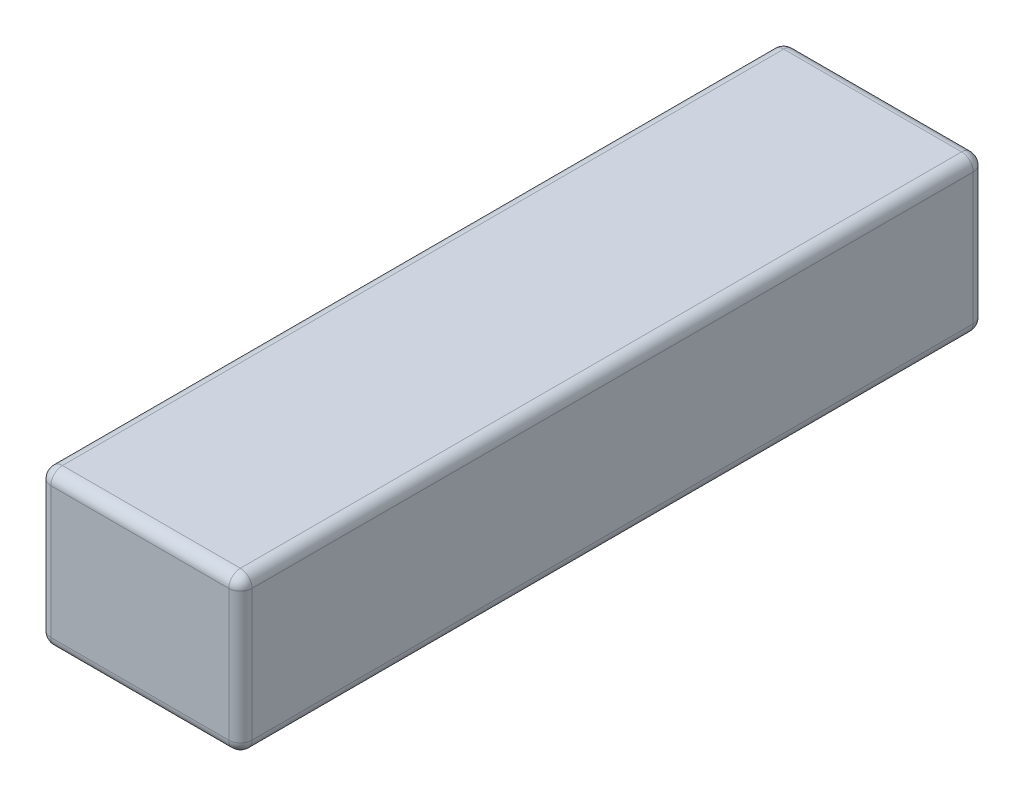
ISO-10303-21;
HEADER;
FILE_DESCRIPTION(('STEP AP214'),'2;1');
FILE_NAME('part.step','',(''),(''),'','','');
FILE_SCHEMA(('AUTOMOTIVE_DESIGN { 1 0 10303 214 1 1 1 1 }'));
ENDSEC;
DATA;
#1=APPLICATION_CONTEXT('core data for automotive mechanical design processes');
#2=APPLICATION_PROTOCOL_DEFINITION('international standard','automotive_design',2000,#1);
#3=PRODUCT_CONTEXT('',#1,'mechanical');
#4=PRODUCT('Part','Part','',(#3));
#5=PRODUCT_RELATED_PRODUCT_CATEGORY('part','',(#4));
#6=PRODUCT_DEFINITION_FORMATION('','',#4);
#7=PRODUCT_DEFINITION_CONTEXT('part definition',#1,'design');
#8=PRODUCT_DEFINITION('design','',#6,#7);
#9=PRODUCT_DEFINITION_SHAPE('','',#8);
#10=(LENGTH_UNIT() NAMED_UNIT(*) SI_UNIT(.MILLI.,.METRE.));
#11=(NAMED_UNIT(*) PLANE_ANGLE_UNIT() SI_UNIT($,.RADIAN.));
#12=(NAMED_UNIT(*) SI_UNIT($,.STERADIAN.) SOLID_ANGLE_UNIT());
#13=UNCERTAINTY_MEASURE_WITH_UNIT(LENGTH_MEASURE(1.E-05),#10,'distance_accuracy_value','');
#14=(GEOMETRIC_REPRESENTATION_CONTEXT(3) GLOBAL_UNCERTAINTY_ASSIGNED_CONTEXT((#13)) GLOBAL_UNIT_ASSIGNED_CONTEXT((#10,
#11,#12)) REPRESENTATION_CONTEXT('',''));
#15=CARTESIAN_POINT('',(0.,0.,0.));
#16=DIRECTION('',(0.,0.,1.));
#17=DIRECTION('',(1.,0.,0.));
#18=AXIS2_PLACEMENT_3D('',#15,#16,#17);
#19=CARTESIAN_POINT('',(-8.65,6.65,64.));
#20=DIRECTION('',(1.,0.,0.));
#21=DIRECTION('',(0.,1.,0.));
#22=AXIS2_PLACEMENT_3D('',#19,#20,#21);
#23=PLANE('',#22);
#24=DIRECTION('',(0.,0.,-1.));
#25=VECTOR('',#24,1.);
#26=CARTESIAN_POINT('',(-8.65,-5.65,64.));
#27=LINE('',#26,#25);
#28=CARTESIAN_POINT('',(-8.65,-5.65,1.));
#29=VERTEX_POINT('',#28);
#30=CARTESIAN_POINT('',(-8.65,-5.65,63.));
#31=VERTEX_POINT('',#30);
#32=EDGE_CURVE('E135',#29,#31,#27,.F.);
#33=ORIENTED_EDGE('',*,*,#32,.T.);
#34=DIRECTION('',(0.,-1.,0.));
#35=VECTOR('',#34,1.);
#36=CARTESIAN_POINT('',(-8.65,6.65,63.));
#37=LINE('',#36,#35);
#38=CARTESIAN_POINT('',(-8.65,5.65,63.));
#39=VERTEX_POINT('',#38);
#40=EDGE_CURVE('E181',#31,#39,#37,.F.);
#41=ORIENTED_EDGE('',*,*,#40,.T.);
#42=DIRECTION('',(0.,0.,-1.));
#43=VECTOR('',#42,1.);
#44=CARTESIAN_POINT('',(-8.65,5.65,64.));
#45=LINE('',#44,#43);
#46=CARTESIAN_POINT('',(-8.65,5.65,1.));
#47=VERTEX_POINT('',#46);
#48=EDGE_CURVE('E176',#39,#47,#45,.T.);
#49=ORIENTED_EDGE('',*,*,#48,.T.);
#50=DIRECTION('',(0.,-1.,0.));
#51=VECTOR('',#50,1.);
#52=CARTESIAN_POINT('',(-8.65,6.65,1.));
#53=LINE('',#52,#51);
#54=EDGE_CURVE('E170',#47,#29,#53,.T.);
#55=ORIENTED_EDGE('',*,*,#54,.T.);
#56=EDGE_LOOP('',(#33,#41,#49,#55));
#57=FACE_BOUND('',#56,.T.);
#58=ADVANCED_FACE('F39',(#57),#23,.F.);
#59=CARTESIAN_POINT('',(-8.65,-6.65,64.));
#60=DIRECTION('',(0.,1.,0.));
#61=DIRECTION('',(0.,0.,1.));
#62=AXIS2_PLACEMENT_3D('',#59,#60,#61);
#63=PLANE('',#62);
#64=DIRECTION('',(0.,0.,-1.));
#65=VECTOR('',#64,1.);
#66=CARTESIAN_POINT('',(7.65,-6.65,64.));
#67=LINE('',#66,#65);
#68=CARTESIAN_POINT('',(7.65,-6.65,1.));
#69=VERTEX_POINT('',#68);
#70=CARTESIAN_POINT('',(7.65,-6.65,63.));
#71=VERTEX_POINT('',#70);
#72=EDGE_CURVE('E160',#69,#71,#67,.F.);
#73=ORIENTED_EDGE('',*,*,#72,.T.);
#74=DIRECTION('',(1.,0.,0.));
#75=VECTOR('',#74,1.);
#76=CARTESIAN_POINT('',(-8.65,-6.65,63.));
#77=LINE('',#76,#75);
#78=CARTESIAN_POINT('',(-7.65,-6.65,63.));
#79=VERTEX_POINT('',#78);
#80=EDGE_CURVE('E164',#71,#79,#77,.F.);
#81=ORIENTED_EDGE('',*,*,#80,.T.);
#82=DIRECTION('',(0.,0.,-1.));
#83=VECTOR('',#82,1.);
#84=CARTESIAN_POINT('',(-7.65,-6.65,64.));
#85=LINE('',#84,#83);
#86=CARTESIAN_POINT('',(-7.65,-6.65,1.));
#87=VERTEX_POINT('',#86);
#88=EDGE_CURVE('E133',#79,#87,#85,.T.);
#89=ORIENTED_EDGE('',*,*,#88,.T.);
#90=DIRECTION('',(1.,0.,0.));
#91=VECTOR('',#90,1.);
#92=CARTESIAN_POINT('',(-8.65,-6.65,1.));
#93=LINE('',#92,#91);
#94=EDGE_CURVE('E153',#87,#69,#93,.T.);
#95=ORIENTED_EDGE('',*,*,#94,.T.);
#96=EDGE_LOOP('',(#73,#81,#89,#95));
#97=FACE_BOUND('',#96,.T.);
#98=ADVANCED_FACE('F162',(#97),#63,.F.);
#99=CARTESIAN_POINT('',(8.65,6.65,64.));
#100=DIRECTION('',(-1.,0.,0.));
#101=DIRECTION('',(0.,-1.,0.));
#102=AXIS2_PLACEMENT_3D('',#99,#100,#101);
#103=PLANE('',#102);
#104=DIRECTION('',(0.,0.,-1.));
#105=VECTOR('',#104,1.);
#106=CARTESIAN_POINT('',(8.65,5.65,64.));
#107=LINE('',#106,#105);
#108=CARTESIAN_POINT('',(8.65,5.65,1.));
#109=VERTEX_POINT('',#108);
#110=CARTESIAN_POINT('',(8.65,5.65,63.));
#111=VERTEX_POINT('',#110);
#112=EDGE_CURVE('E187',#109,#111,#107,.F.);
#113=ORIENTED_EDGE('',*,*,#112,.T.);
#114=DIRECTION('',(0.,1.,0.));
#115=VECTOR('',#114,1.);
#116=CARTESIAN_POINT('',(8.65,-6.65,63.));
#117=LINE('',#116,#115);
#118=CARTESIAN_POINT('',(8.65,-5.65,63.));
#119=VERTEX_POINT('',#118);
#120=EDGE_CURVE('E194',#111,#119,#117,.F.);
#121=ORIENTED_EDGE('',*,*,#120,.T.);
#122=DIRECTION('',(0.,0.,-1.));
#123=VECTOR('',#122,1.);
#124=CARTESIAN_POINT('',(8.65,-5.65,64.));
#125=LINE('',#124,#123);
#126=CARTESIAN_POINT('',(8.65,-5.65,1.));
#127=VERTEX_POINT('',#126);
#128=EDGE_CURVE('E190',#119,#127,#125,.T.);
#129=ORIENTED_EDGE('',*,*,#128,.T.);
#130=DIRECTION('',(0.,1.,0.));
#131=VECTOR('',#130,1.);
#132=CARTESIAN_POINT('',(8.65,6.65,1.));
#133=LINE('',#132,#131);
#134=EDGE_CURVE('E184',#127,#109,#133,.T.);
#135=ORIENTED_EDGE('',*,*,#134,.T.);
#136=EDGE_LOOP('',(#113,#121,#129,#135));
#137=FACE_BOUND('',#136,.T.);
#138=ADVANCED_FACE('F333',(#137),#103,.F.);
#139=CARTESIAN_POINT('',(-8.65,6.65,64.));
#140=DIRECTION('',(0.,-1.,0.));
#141=DIRECTION('',(0.,0.,-1.));
#142=AXIS2_PLACEMENT_3D('',#139,#140,#141);
#143=PLANE('',#142);
#144=DIRECTION('',(0.,0.,-1.));
#145=VECTOR('',#144,1.);
#146=CARTESIAN_POINT('',(-7.65,6.65,64.));
#147=LINE('',#146,#145);
#148=CARTESIAN_POINT('',(-7.65,6.65,1.));
#149=VERTEX_POINT('',#148);
#150=CARTESIAN_POINT('',(-7.65,6.65,63.));
#151=VERTEX_POINT('',#150);
#152=EDGE_CURVE('E200',#149,#151,#147,.F.);
#153=ORIENTED_EDGE('',*,*,#152,.T.);
#154=DIRECTION('',(-1.,0.,0.));
#155=VECTOR('',#154,1.);
#156=CARTESIAN_POINT('',(8.65,6.65,63.));
#157=LINE('',#156,#155);
#158=CARTESIAN_POINT('',(7.65,6.65,63.));
#159=VERTEX_POINT('',#158);
#160=EDGE_CURVE('E207',#151,#159,#157,.F.);
#161=ORIENTED_EDGE('',*,*,#160,.T.);
#162=DIRECTION('',(0.,0.,-1.));
#163=VECTOR('',#162,1.);
#164=CARTESIAN_POINT('',(7.65,6.65,64.));
#165=LINE('',#164,#163);
#166=CARTESIAN_POINT('',(7.65,6.65,1.));
#167=VERTEX_POINT('',#166);
#168=EDGE_CURVE('E203',#159,#167,#165,.T.);
#169=ORIENTED_EDGE('',*,*,#168,.T.);
#170=DIRECTION('',(-1.,0.,0.));
#171=VECTOR('',#170,1.);
#172=CARTESIAN_POINT('',(-8.65,6.65,1.));
#173=LINE('',#172,#171);
#174=EDGE_CURVE('E197',#167,#149,#173,.T.);
#175=ORIENTED_EDGE('',*,*,#174,.T.);
#176=EDGE_LOOP('',(#153,#161,#169,#175));
#177=FACE_BOUND('',#176,.T.);
#178=ADVANCED_FACE('F343',(#177),#143,.F.);
#179=CARTESIAN_POINT('',(0.,0.,64.));
#180=DIRECTION('',(0.,0.,1.));
#181=DIRECTION('',(1.,0.,0.));
#182=AXIS2_PLACEMENT_3D('',#179,#180,#181);
#183=PLANE('',#182);
#184=DIRECTION('',(0.,1.,0.));
#185=VECTOR('',#184,1.);
#186=CARTESIAN_POINT('',(7.65,6.65,64.));
#187=LINE('',#186,#185);
#188=CARTESIAN_POINT('',(7.65,-5.65,64.));
#189=VERTEX_POINT('',#188);
#190=CARTESIAN_POINT('',(7.65,5.65,64.));
#191=VERTEX_POINT('',#190);
#192=EDGE_CURVE('E216',#189,#191,#187,.T.);
#193=ORIENTED_EDGE('',*,*,#192,.T.);
#194=DIRECTION('',(-1.,0.,0.));
#195=VECTOR('',#194,1.);
#196=CARTESIAN_POINT('',(-8.65,5.65,64.));
#197=LINE('',#196,#195);
#198=CARTESIAN_POINT('',(-7.65,5.65,64.));
#199=VERTEX_POINT('',#198);
#200=EDGE_CURVE('E219',#191,#199,#197,.T.);
#201=ORIENTED_EDGE('',*,*,#200,.T.);
#202=DIRECTION('',(0.,-1.,0.));
#203=VECTOR('',#202,1.);
#204=CARTESIAN_POINT('',(-7.65,-6.65,64.));
#205=LINE('',#204,#203);
#206=CARTESIAN_POINT('',(-7.65,-5.65,64.));
#207=VERTEX_POINT('',#206);
#208=EDGE_CURVE('E210',#199,#207,#205,.T.);
#209=ORIENTED_EDGE('',*,*,#208,.T.);
#210=DIRECTION('',(1.,0.,0.));
#211=VECTOR('',#210,1.);
#212=CARTESIAN_POINT('',(8.65,-5.65,64.));
#213=LINE('',#212,#211);
#214=EDGE_CURVE('E213',#207,#189,#213,.T.);
#215=ORIENTED_EDGE('',*,*,#214,.T.);
#216=EDGE_LOOP('',(#193,#201,#209,#215));
#217=FACE_BOUND('',#216,.T.);
#218=ADVANCED_FACE('F325',(#217),#183,.T.);
#219=CARTESIAN_POINT('',(0.,0.,0.));
#220=DIRECTION('',(0.,0.,1.));
#221=DIRECTION('',(1.,0.,0.));
#222=AXIS2_PLACEMENT_3D('',#219,#220,#221);
#223=PLANE('',#222);
#224=DIRECTION('',(0.,-1.,0.));
#225=VECTOR('',#224,1.);
#226=CARTESIAN_POINT('',(-7.65,0.,0.));
#227=LINE('',#226,#225);
#228=CARTESIAN_POINT('',(-7.65,-5.65,0.));
#229=VERTEX_POINT('',#228);
#230=CARTESIAN_POINT('',(-7.65,5.65,0.));
#231=VERTEX_POINT('',#230);
#232=EDGE_CURVE('E223',#229,#231,#227,.F.);
#233=ORIENTED_EDGE('',*,*,#232,.T.);
#234=DIRECTION('',(-1.,0.,0.));
#235=VECTOR('',#234,1.);
#236=CARTESIAN_POINT('',(0.,5.65,0.));
#237=LINE('',#236,#235);
#238=CARTESIAN_POINT('',(7.65,5.65,0.));
#239=VERTEX_POINT('',#238);
#240=EDGE_CURVE('E11',#231,#239,#237,.F.);
#241=ORIENTED_EDGE('',*,*,#240,.T.);
#242=DIRECTION('',(0.,1.,0.));
#243=VECTOR('',#242,1.);
#244=CARTESIAN_POINT('',(7.65,0.,0.));
#245=LINE('',#244,#243);
#246=CARTESIAN_POINT('',(7.65,-5.65,0.));
#247=VERTEX_POINT('',#246);
#248=EDGE_CURVE('E49',#239,#247,#245,.F.);
#249=ORIENTED_EDGE('',*,*,#248,.T.);
#250=DIRECTION('',(1.,0.,0.));
#251=VECTOR('',#250,1.);
#252=CARTESIAN_POINT('',(0.,-5.65,0.));
#253=LINE('',#252,#251);
#254=EDGE_CURVE('E226',#247,#229,#253,.F.);
#255=ORIENTED_EDGE('',*,*,#254,.T.);
#256=EDGE_LOOP('',(#233,#241,#249,#255));
#257=FACE_BOUND('',#256,.T.);
#258=ADVANCED_FACE('F532',(#257),#223,.F.);
#259=CARTESIAN_POINT('',(7.65,5.65,64.));
#260=DIRECTION('',(0.,0.,-1.));
#261=DIRECTION('',(-1.,0.,0.));
#262=AXIS2_PLACEMENT_3D('',#259,#260,#261);
#263=CYLINDRICAL_SURFACE('',#262,1.);
#264=CARTESIAN_POINT('',(7.65,5.65,63.));
#265=DIRECTION('',(0.,0.,1.));
#266=DIRECTION('',(1.,0.,0.));
#267=AXIS2_PLACEMENT_3D('',#264,#265,#266);
#268=CIRCLE('',#267,1.);
#269=EDGE_CURVE('E43',#111,#159,#268,.T.);
#270=ORIENTED_EDGE('',*,*,#269,.F.);
#271=ORIENTED_EDGE('',*,*,#112,.F.);
#272=CARTESIAN_POINT('',(7.65,5.65,1.));
#273=DIRECTION('',(0.,0.,-1.));
#274=DIRECTION('',(-1.,0.,0.));
#275=AXIS2_PLACEMENT_3D('',#272,#273,#274);
#276=CIRCLE('',#275,1.);
#277=EDGE_CURVE('E301',#167,#109,#276,.T.);
#278=ORIENTED_EDGE('',*,*,#277,.F.);
#279=ORIENTED_EDGE('',*,*,#168,.F.);
#280=EDGE_LOOP('',(#270,#271,#278,#279));
#281=FACE_BOUND('',#280,.T.);
#282=ADVANCED_FACE('F41',(#281),#263,.T.);
#283=CARTESIAN_POINT('',(7.65,5.65,63.));
#284=DIRECTION('',(0.,1.,0.));
#285=DIRECTION('',(-1.,0.,0.));
#286=AXIS2_PLACEMENT_3D('',#283,#284,#285);
#287=SPHERICAL_SURFACE('',#286,1.);
#288=CARTESIAN_POINT('',(7.65,5.65,63.));
#289=DIRECTION('',(0.,1.,0.));
#290=DIRECTION('',(0.,0.,1.));
#291=AXIS2_PLACEMENT_3D('',#288,#289,#290);
#292=CIRCLE('',#291,1.);
#293=EDGE_CURVE('E294',#111,#191,#292,.F.);
#294=ORIENTED_EDGE('',*,*,#293,.F.);
#295=ORIENTED_EDGE('',*,*,#269,.T.);
#296=CARTESIAN_POINT('',(7.65,5.65,63.));
#297=DIRECTION('',(1.,0.,0.));
#298=DIRECTION('',(0.,0.,-1.));
#299=AXIS2_PLACEMENT_3D('',#296,#297,#298);
#300=CIRCLE('',#299,1.);
#301=EDGE_CURVE('E298',#191,#159,#300,.F.);
#302=ORIENTED_EDGE('',*,*,#301,.F.);
#303=EDGE_LOOP('',(#294,#295,#302));
#304=FACE_BOUND('',#303,.T.);
#305=ADVANCED_FACE('F313',(#304),#287,.T.);
#306=CARTESIAN_POINT('',(7.65,5.65,1.));
#307=DIRECTION('',(1.,0.,0.));
#308=DIRECTION('',(0.,0.,-1.));
#309=AXIS2_PLACEMENT_3D('',#306,#307,#308);
#310=SPHERICAL_SURFACE('',#309,1.);
#311=CARTESIAN_POINT('',(7.65,5.65,1.));
#312=DIRECTION('',(1.,0.,0.));
#313=DIRECTION('',(0.,1.,0.));
#314=AXIS2_PLACEMENT_3D('',#311,#312,#313);
#315=CIRCLE('',#314,1.);
#316=EDGE_CURVE('E287',#167,#239,#315,.F.);
#317=ORIENTED_EDGE('',*,*,#316,.F.);
#318=ORIENTED_EDGE('',*,*,#277,.T.);
#319=CARTESIAN_POINT('',(7.65,5.65,1.));
#320=DIRECTION('',(0.,1.,0.));
#321=DIRECTION('',(0.,0.,1.));
#322=AXIS2_PLACEMENT_3D('',#319,#320,#321);
#323=CIRCLE('',#322,1.);
#324=EDGE_CURVE('E291',#239,#109,#323,.F.);
#325=ORIENTED_EDGE('',*,*,#324,.F.);
#326=EDGE_LOOP('',(#317,#318,#325));
#327=FACE_BOUND('',#326,.T.);
#328=ADVANCED_FACE('F511',(#327),#310,.T.);
#329=CARTESIAN_POINT('',(0.,5.65,63.));
#330=DIRECTION('',(1.,0.,0.));
#331=DIRECTION('',(0.,0.,-1.));
#332=AXIS2_PLACEMENT_3D('',#329,#330,#331);
#333=CYLINDRICAL_SURFACE('',#332,1.);
#334=ORIENTED_EDGE('',*,*,#301,.T.);
#335=ORIENTED_EDGE('',*,*,#160,.F.);
#336=CARTESIAN_POINT('',(-7.65,5.65,63.));
#337=DIRECTION('',(-1.,0.,0.));
#338=DIRECTION('',(0.,0.,1.));
#339=AXIS2_PLACEMENT_3D('',#336,#337,#338);
#340=CIRCLE('',#339,1.);
#341=EDGE_CURVE('E279',#199,#151,#340,.T.);
#342=ORIENTED_EDGE('',*,*,#341,.F.);
#343=ORIENTED_EDGE('',*,*,#200,.F.);
#344=EDGE_LOOP('',(#334,#335,#342,#343));
#345=FACE_BOUND('',#344,.T.);
#346=ADVANCED_FACE('F321',(#345),#333,.T.);
#347=CARTESIAN_POINT('',(7.65,0.,63.));
#348=DIRECTION('',(0.,-1.,0.));
#349=DIRECTION('',(1.,0.,0.));
#350=AXIS2_PLACEMENT_3D('',#347,#348,#349);
#351=CYLINDRICAL_SURFACE('',#350,1.);
#352=ORIENTED_EDGE('',*,*,#293,.T.);
#353=ORIENTED_EDGE('',*,*,#192,.F.);
#354=CARTESIAN_POINT('',(7.65,-5.65,63.));
#355=DIRECTION('',(0.,-1.,0.));
#356=DIRECTION('',(0.,0.,-1.));
#357=AXIS2_PLACEMENT_3D('',#354,#355,#356);
#358=CIRCLE('',#357,1.);
#359=EDGE_CURVE('E275',#119,#189,#358,.T.);
#360=ORIENTED_EDGE('',*,*,#359,.F.);
#361=ORIENTED_EDGE('',*,*,#120,.F.);
#362=EDGE_LOOP('',(#352,#353,#360,#361));
#363=FACE_BOUND('',#362,.T.);
#364=ADVANCED_FACE('F330',(#363),#351,.T.);
#365=CARTESIAN_POINT('',(7.65,-5.65,64.));
#366=DIRECTION('',(0.,0.,-1.));
#367=DIRECTION('',(-1.,0.,0.));
#368=AXIS2_PLACEMENT_3D('',#365,#366,#367);
#369=CYLINDRICAL_SURFACE('',#368,1.);
#370=CARTESIAN_POINT('',(7.65,-5.65,1.));
#371=DIRECTION('',(0.,0.,-1.));
#372=DIRECTION('',(-1.,0.,0.));
#373=AXIS2_PLACEMENT_3D('',#370,#371,#372);
#374=CIRCLE('',#373,1.);
#375=EDGE_CURVE('E267',#127,#69,#374,.T.);
#376=ORIENTED_EDGE('',*,*,#375,.F.);
#377=ORIENTED_EDGE('',*,*,#128,.F.);
#378=CARTESIAN_POINT('',(7.65,-5.65,63.));
#379=DIRECTION('',(0.,0.,1.));
#380=DIRECTION('',(1.,0.,0.));
#381=AXIS2_PLACEMENT_3D('',#378,#379,#380);
#382=CIRCLE('',#381,1.);
#383=EDGE_CURVE('E271',#71,#119,#382,.T.);
#384=ORIENTED_EDGE('',*,*,#383,.F.);
#385=ORIENTED_EDGE('',*,*,#72,.F.);
#386=EDGE_LOOP('',(#376,#377,#384,#385));
#387=FACE_BOUND('',#386,.T.);
#388=ADVANCED_FACE('F337',(#387),#369,.T.);
#389=CARTESIAN_POINT('',(7.65,6.65,1.));
#390=DIRECTION('',(0.,1.,0.));
#391=DIRECTION('',(-1.,0.,0.));
#392=AXIS2_PLACEMENT_3D('',#389,#390,#391);
#393=CYLINDRICAL_SURFACE('',#392,1.);
#394=ORIENTED_EDGE('',*,*,#324,.T.);
#395=ORIENTED_EDGE('',*,*,#134,.F.);
#396=CARTESIAN_POINT('',(7.65,-5.65,1.));
#397=DIRECTION('',(0.,-1.,0.));
#398=DIRECTION('',(1.,0.,0.));
#399=AXIS2_PLACEMENT_3D('',#396,#397,#398);
#400=CIRCLE('',#399,1.);
#401=EDGE_CURVE('E264',#247,#127,#400,.T.);
#402=ORIENTED_EDGE('',*,*,#401,.F.);
#403=ORIENTED_EDGE('',*,*,#248,.F.);
#404=EDGE_LOOP('',(#394,#395,#402,#403));
#405=FACE_BOUND('',#404,.T.);
#406=ADVANCED_FACE('F341',(#405),#393,.T.);
#407=CARTESIAN_POINT('',(-8.65,5.65,1.));
#408=DIRECTION('',(-1.,0.,0.));
#409=DIRECTION('',(0.,0.,1.));
#410=AXIS2_PLACEMENT_3D('',#407,#408,#409);
#411=CYLINDRICAL_SURFACE('',#410,1.);
#412=ORIENTED_EDGE('',*,*,#316,.T.);
#413=ORIENTED_EDGE('',*,*,#240,.F.);
#414=CARTESIAN_POINT('',(-7.65,5.65,1.));
#415=DIRECTION('',(-1.,0.,0.));
#416=DIRECTION('',(0.,0.,1.));
#417=AXIS2_PLACEMENT_3D('',#414,#415,#416);
#418=CIRCLE('',#417,1.);
#419=EDGE_CURVE('E260',#149,#231,#418,.T.);
#420=ORIENTED_EDGE('',*,*,#419,.F.);
#421=ORIENTED_EDGE('',*,*,#174,.F.);
#422=EDGE_LOOP('',(#412,#413,#420,#421));
#423=FACE_BOUND('',#422,.T.);
#424=ADVANCED_FACE('F353',(#423),#411,.T.);
#425=CARTESIAN_POINT('',(-7.65,5.65,64.));
#426=DIRECTION('',(0.,0.,-1.));
#427=DIRECTION('',(-1.,0.,0.));
#428=AXIS2_PLACEMENT_3D('',#425,#426,#427);
#429=CYLINDRICAL_SURFACE('',#428,1.);
#430=CARTESIAN_POINT('',(-7.65,5.65,63.));
#431=DIRECTION('',(0.,0.,1.));
#432=DIRECTION('',(1.,0.,0.));
#433=AXIS2_PLACEMENT_3D('',#430,#431,#432);
#434=CIRCLE('',#433,1.);
#435=EDGE_CURVE('E283',#151,#39,#434,.T.);
#436=ORIENTED_EDGE('',*,*,#435,.F.);
#437=ORIENTED_EDGE('',*,*,#152,.F.);
#438=CARTESIAN_POINT('',(-7.65,5.65,1.));
#439=DIRECTION('',(0.,0.,-1.));
#440=DIRECTION('',(-1.,0.,0.));
#441=AXIS2_PLACEMENT_3D('',#438,#439,#440);
#442=CIRCLE('',#441,1.);
#443=EDGE_CURVE('E256',#47,#149,#442,.T.);
#444=ORIENTED_EDGE('',*,*,#443,.F.);
#445=ORIENTED_EDGE('',*,*,#48,.F.);
#446=EDGE_LOOP('',(#436,#437,#444,#445));
#447=FACE_BOUND('',#446,.T.);
#448=ADVANCED_FACE('F348',(#447),#429,.T.);
#449=CARTESIAN_POINT('',(-7.65,5.65,63.));
#450=DIRECTION('',(0.,1.,0.));
#451=DIRECTION('',(0.,0.,1.));
#452=AXIS2_PLACEMENT_3D('',#449,#450,#451);
#453=SPHERICAL_SURFACE('',#452,1.);
#454=ORIENTED_EDGE('',*,*,#341,.T.);
#455=ORIENTED_EDGE('',*,*,#435,.T.);
#456=CARTESIAN_POINT('',(-7.65,5.65,63.));
#457=DIRECTION('',(0.,1.,0.));
#458=DIRECTION('',(0.,0.,1.));
#459=AXIS2_PLACEMENT_3D('',#456,#457,#458);
#460=CIRCLE('',#459,1.);
#461=EDGE_CURVE('E252',#199,#39,#460,.F.);
#462=ORIENTED_EDGE('',*,*,#461,.F.);
#463=EDGE_LOOP('',(#454,#455,#462));
#464=FACE_BOUND('',#463,.T.);
#465=ADVANCED_FACE('F364',(#464),#453,.T.);
#466=CARTESIAN_POINT('',(7.65,-5.65,63.));
#467=DIRECTION('',(1.,0.,0.));
#468=DIRECTION('',(0.,1.,0.));
#469=AXIS2_PLACEMENT_3D('',#466,#467,#468);
#470=SPHERICAL_SURFACE('',#469,1.);
#471=ORIENTED_EDGE('',*,*,#383,.T.);
#472=ORIENTED_EDGE('',*,*,#359,.T.);
#473=CARTESIAN_POINT('',(7.65,-5.65,63.));
#474=DIRECTION('',(1.,0.,0.));
#475=DIRECTION('',(0.,0.,-1.));
#476=AXIS2_PLACEMENT_3D('',#473,#474,#475);
#477=CIRCLE('',#476,1.);
#478=EDGE_CURVE('E248',#71,#189,#477,.F.);
#479=ORIENTED_EDGE('',*,*,#478,.F.);
#480=EDGE_LOOP('',(#471,#472,#479));
#481=FACE_BOUND('',#480,.T.);
#482=ADVANCED_FACE('F374',(#481),#470,.T.);
#483=CARTESIAN_POINT('',(7.65,-5.65,1.));
#484=DIRECTION('',(1.,0.,0.));
#485=DIRECTION('',(0.,0.,-1.));
#486=AXIS2_PLACEMENT_3D('',#483,#484,#485);
#487=SPHERICAL_SURFACE('',#486,1.);
#488=ORIENTED_EDGE('',*,*,#401,.T.);
#489=ORIENTED_EDGE('',*,*,#375,.T.);
#490=CARTESIAN_POINT('',(7.65,-5.65,1.));
#491=DIRECTION('',(1.,0.,0.));
#492=DIRECTION('',(0.,0.,-1.));
#493=AXIS2_PLACEMENT_3D('',#490,#491,#492);
#494=CIRCLE('',#493,1.);
#495=EDGE_CURVE('E156',#247,#69,#494,.F.);
#496=ORIENTED_EDGE('',*,*,#495,.F.);
#497=EDGE_LOOP('',(#488,#489,#496));
#498=FACE_BOUND('',#497,.T.);
#499=ADVANCED_FACE('F376',(#498),#487,.T.);
#500=CARTESIAN_POINT('',(-7.65,5.65,1.));
#501=DIRECTION('',(0.,1.,0.));
#502=DIRECTION('',(0.,0.,1.));
#503=AXIS2_PLACEMENT_3D('',#500,#501,#502);
#504=SPHERICAL_SURFACE('',#503,1.);
#505=ORIENTED_EDGE('',*,*,#443,.T.);
#506=ORIENTED_EDGE('',*,*,#419,.T.);
#507=CARTESIAN_POINT('',(-7.65,5.65,1.));
#508=DIRECTION('',(0.,1.,0.));
#509=DIRECTION('',(0.,0.,1.));
#510=AXIS2_PLACEMENT_3D('',#507,#508,#509);
#511=CIRCLE('',#510,1.);
#512=EDGE_CURVE('E242',#47,#231,#511,.F.);
#513=ORIENTED_EDGE('',*,*,#512,.F.);
#514=EDGE_LOOP('',(#505,#506,#513));
#515=FACE_BOUND('',#514,.T.);
#516=ADVANCED_FACE('F355',(#515),#504,.T.);
#517=CARTESIAN_POINT('',(-7.65,0.,63.));
#518=DIRECTION('',(0.,1.,0.));
#519=DIRECTION('',(-1.,0.,0.));
#520=AXIS2_PLACEMENT_3D('',#517,#518,#519);
#521=CYLINDRICAL_SURFACE('',#520,1.);
#522=ORIENTED_EDGE('',*,*,#461,.T.);
#523=ORIENTED_EDGE('',*,*,#40,.F.);
#524=CARTESIAN_POINT('',(-7.65,-5.65,63.));
#525=DIRECTION('',(0.,-1.,0.));
#526=DIRECTION('',(0.,0.,-1.));
#527=AXIS2_PLACEMENT_3D('',#524,#525,#526);
#528=CIRCLE('',#527,1.);
#529=EDGE_CURVE('E238',#207,#31,#528,.T.);
#530=ORIENTED_EDGE('',*,*,#529,.F.);
#531=ORIENTED_EDGE('',*,*,#208,.F.);
#532=EDGE_LOOP('',(#522,#523,#530,#531));
#533=FACE_BOUND('',#532,.T.);
#534=ADVANCED_FACE('F366',(#533),#521,.T.);
#535=CARTESIAN_POINT('',(0.,-5.65,63.));
#536=DIRECTION('',(-1.,0.,0.));
#537=DIRECTION('',(0.,0.,1.));
#538=AXIS2_PLACEMENT_3D('',#535,#536,#537);
#539=CYLINDRICAL_SURFACE('',#538,1.);
#540=ORIENTED_EDGE('',*,*,#478,.T.);
#541=ORIENTED_EDGE('',*,*,#214,.F.);
#542=CARTESIAN_POINT('',(-7.65,-5.65,63.));
#543=DIRECTION('',(-1.,0.,0.));
#544=DIRECTION('',(0.,0.,1.));
#545=AXIS2_PLACEMENT_3D('',#542,#543,#544);
#546=CIRCLE('',#545,1.);
#547=EDGE_CURVE('E150',#79,#207,#546,.T.);
#548=ORIENTED_EDGE('',*,*,#547,.F.);
#549=ORIENTED_EDGE('',*,*,#80,.F.);
#550=EDGE_LOOP('',(#540,#541,#548,#549));
#551=FACE_BOUND('',#550,.T.);
#552=ADVANCED_FACE('F372',(#551),#539,.T.);
#553=CARTESIAN_POINT('',(-8.65,-5.65,1.));
#554=DIRECTION('',(1.,0.,0.));
#555=DIRECTION('',(0.,0.,-1.));
#556=AXIS2_PLACEMENT_3D('',#553,#554,#555);
#557=CYLINDRICAL_SURFACE('',#556,1.);
#558=ORIENTED_EDGE('',*,*,#495,.T.);
#559=ORIENTED_EDGE('',*,*,#94,.F.);
#560=CARTESIAN_POINT('',(-7.65,-5.65,1.));
#561=DIRECTION('',(-1.,0.,0.));
#562=DIRECTION('',(0.,0.,1.));
#563=AXIS2_PLACEMENT_3D('',#560,#561,#562);
#564=CIRCLE('',#563,1.);
#565=EDGE_CURVE('E142',#229,#87,#564,.T.);
#566=ORIENTED_EDGE('',*,*,#565,.F.);
#567=ORIENTED_EDGE('',*,*,#254,.F.);
#568=EDGE_LOOP('',(#558,#559,#566,#567));
#569=FACE_BOUND('',#568,.T.);
#570=ADVANCED_FACE('F154',(#569),#557,.T.);
#571=CARTESIAN_POINT('',(-7.65,6.65,1.));
#572=DIRECTION('',(0.,-1.,0.));
#573=DIRECTION('',(1.,0.,0.));
#574=AXIS2_PLACEMENT_3D('',#571,#572,#573);
#575=CYLINDRICAL_SURFACE('',#574,1.);
#576=ORIENTED_EDGE('',*,*,#512,.T.);
#577=ORIENTED_EDGE('',*,*,#232,.F.);
#578=CARTESIAN_POINT('',(-7.65,-5.65,1.));
#579=DIRECTION('',(0.,-1.,0.));
#580=DIRECTION('',(0.,0.,-1.));
#581=AXIS2_PLACEMENT_3D('',#578,#579,#580);
#582=CIRCLE('',#581,1.);
#583=EDGE_CURVE('E146',#29,#229,#582,.T.);
#584=ORIENTED_EDGE('',*,*,#583,.F.);
#585=ORIENTED_EDGE('',*,*,#54,.F.);
#586=EDGE_LOOP('',(#576,#577,#584,#585));
#587=FACE_BOUND('',#586,.T.);
#588=ADVANCED_FACE('F359',(#587),#575,.T.);
#589=CARTESIAN_POINT('',(-7.65,-5.65,63.));
#590=DIRECTION('',(0.,0.,1.));
#591=DIRECTION('',(1.,0.,0.));
#592=AXIS2_PLACEMENT_3D('',#589,#590,#591);
#593=SPHERICAL_SURFACE('',#592,1.);
#594=ORIENTED_EDGE('',*,*,#547,.T.);
#595=ORIENTED_EDGE('',*,*,#529,.T.);
#596=CARTESIAN_POINT('',(-7.65,-5.65,63.));
#597=DIRECTION('',(0.,0.,1.));
#598=DIRECTION('',(1.,0.,0.));
#599=AXIS2_PLACEMENT_3D('',#596,#597,#598);
#600=CIRCLE('',#599,1.);
#601=EDGE_CURVE('E139',#79,#31,#600,.F.);
#602=ORIENTED_EDGE('',*,*,#601,.F.);
#603=EDGE_LOOP('',(#594,#595,#602));
#604=FACE_BOUND('',#603,.T.);
#605=ADVANCED_FACE('F370',(#604),#593,.T.);
#606=CARTESIAN_POINT('',(-7.65,-5.65,1.));
#607=DIRECTION('',(0.,0.,-1.));
#608=DIRECTION('',(-1.,0.,0.));
#609=AXIS2_PLACEMENT_3D('',#606,#607,#608);
#610=SPHERICAL_SURFACE('',#609,1.);
#611=ORIENTED_EDGE('',*,*,#583,.T.);
#612=ORIENTED_EDGE('',*,*,#565,.T.);
#613=CARTESIAN_POINT('',(-7.65,-5.65,1.));
#614=DIRECTION('',(0.,0.,-1.));
#615=DIRECTION('',(-1.,0.,0.));
#616=AXIS2_PLACEMENT_3D('',#613,#614,#615);
#617=CIRCLE('',#616,1.);
#618=EDGE_CURVE('E129',#29,#87,#617,.F.);
#619=ORIENTED_EDGE('',*,*,#618,.F.);
#620=EDGE_LOOP('',(#611,#612,#619));
#621=FACE_BOUND('',#620,.T.);
#622=ADVANCED_FACE('F144',(#621),#610,.T.);
#623=CARTESIAN_POINT('',(-7.65,-5.65,64.));
#624=DIRECTION('',(0.,0.,-1.));
#625=DIRECTION('',(-1.,0.,0.));
#626=AXIS2_PLACEMENT_3D('',#623,#624,#625);
#627=CYLINDRICAL_SURFACE('',#626,1.);
#628=ORIENTED_EDGE('',*,*,#601,.T.);
#629=ORIENTED_EDGE('',*,*,#32,.F.);
#630=ORIENTED_EDGE('',*,*,#618,.T.);
#631=ORIENTED_EDGE('',*,*,#88,.F.);
#632=EDGE_LOOP('',(#628,#629,#630,#631));
#633=FACE_BOUND('',#632,.T.);
#634=ADVANCED_FACE('F131',(#633),#627,.T.);
#635=CLOSED_SHELL('',(#58,#98,#138,#178,#218,#258,#282,#305,#328,#346,#364,#388,#406,#424,#448,
#465,#482,#499,#516,#534,#552,#570,#588,#605,#622,#634));
#636=MANIFOLD_SOLID_BREP('B2',#635);
#637=ADVANCED_BREP_SHAPE_REPRESENTATION('',(#18,#636),#14);
#638=SHAPE_DEFINITION_REPRESENTATION(#9,#637);
ENDSEC;
END-ISO-10303-21;
